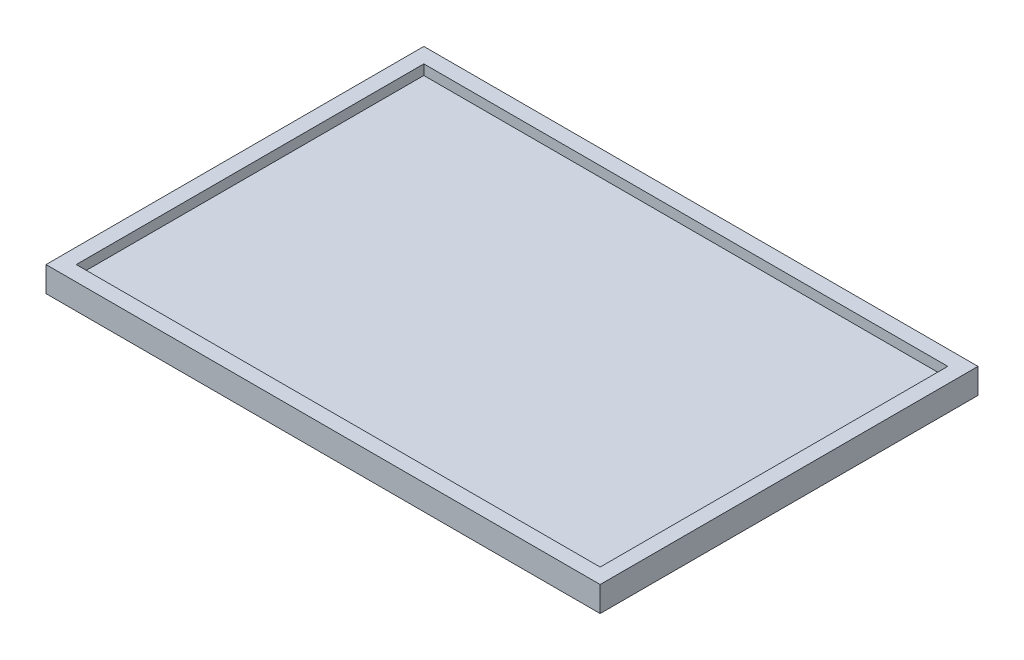
ISO-10303-21;
HEADER;
FILE_DESCRIPTION(('STEP AP214'),'2;1');
FILE_NAME('part.step','',(''),(''),'','','');
FILE_SCHEMA(('AUTOMOTIVE_DESIGN { 1 0 10303 214 1 1 1 1 }'));
ENDSEC;
DATA;
#1=APPLICATION_CONTEXT('core data for automotive mechanical design processes');
#2=APPLICATION_PROTOCOL_DEFINITION('international standard','automotive_design',2000,#1);
#3=PRODUCT_CONTEXT('',#1,'mechanical');
#4=PRODUCT('Part','Part','',(#3));
#5=PRODUCT_RELATED_PRODUCT_CATEGORY('part','',(#4));
#6=PRODUCT_DEFINITION_FORMATION('','',#4);
#7=PRODUCT_DEFINITION_CONTEXT('part definition',#1,'design');
#8=PRODUCT_DEFINITION('design','',#6,#7);
#9=PRODUCT_DEFINITION_SHAPE('','',#8);
#10=(LENGTH_UNIT() NAMED_UNIT(*) SI_UNIT(.MILLI.,.METRE.));
#11=(NAMED_UNIT(*) PLANE_ANGLE_UNIT() SI_UNIT($,.RADIAN.));
#12=(NAMED_UNIT(*) SI_UNIT($,.STERADIAN.) SOLID_ANGLE_UNIT());
#13=UNCERTAINTY_MEASURE_WITH_UNIT(LENGTH_MEASURE(1.E-05),#10,'distance_accuracy_value','');
#14=(GEOMETRIC_REPRESENTATION_CONTEXT(3) GLOBAL_UNCERTAINTY_ASSIGNED_CONTEXT((#13)) GLOBAL_UNIT_ASSIGNED_CONTEXT((#10,
#11,#12)) REPRESENTATION_CONTEXT('',''));
#15=CARTESIAN_POINT('',(0.,0.,0.));
#16=DIRECTION('',(0.,0.,1.));
#17=DIRECTION('',(1.,0.,0.));
#18=AXIS2_PLACEMENT_3D('',#15,#16,#17);
#19=CARTESIAN_POINT('',(-49.8344208809135,5.,-19.8115823817292));
#20=DIRECTION('',(1.,0.,0.));
#21=DIRECTION('',(0.,0.,-1.));
#22=AXIS2_PLACEMENT_3D('',#19,#20,#21);
#23=PLANE('',#22);
#24=DIRECTION('',(0.,0.,1.));
#25=VECTOR('',#24,1.);
#26=CARTESIAN_POINT('',(-49.8344208809135,0.,-19.8115823817292));
#27=LINE('',#26,#25);
#28=CARTESIAN_POINT('',(-49.8344208809135,0.,-19.8115823817292));
#29=VERTEX_POINT('',#28);
#30=CARTESIAN_POINT('',(-49.8344208809135,0.,55.1884176182708));
#31=VERTEX_POINT('',#30);
#32=EDGE_CURVE('E141',#29,#31,#27,.T.);
#33=ORIENTED_EDGE('',*,*,#32,.T.);
#34=DIRECTION('',(0.,-1.,0.));
#35=VECTOR('',#34,1.);
#36=CARTESIAN_POINT('',(-49.8344208809135,5.,55.1884176182708));
#37=LINE('',#36,#35);
#38=CARTESIAN_POINT('',(-49.8344208809135,5.,55.1884176182708));
#39=VERTEX_POINT('',#38);
#40=EDGE_CURVE('E11',#39,#31,#37,.T.);
#41=ORIENTED_EDGE('',*,*,#40,.F.);
#42=DIRECTION('',(0.,0.,1.));
#43=VECTOR('',#42,1.);
#44=CARTESIAN_POINT('',(-49.8344208809135,5.,-19.8115823817292));
#45=LINE('',#44,#43);
#46=CARTESIAN_POINT('',(-49.8344208809135,5.,-19.8115823817292));
#47=VERTEX_POINT('',#46);
#48=EDGE_CURVE('E145',#47,#39,#45,.T.);
#49=ORIENTED_EDGE('',*,*,#48,.F.);
#50=DIRECTION('',(0.,-1.,0.));
#51=VECTOR('',#50,1.);
#52=CARTESIAN_POINT('',(-49.8344208809135,5.,-19.8115823817292));
#53=LINE('',#52,#51);
#54=EDGE_CURVE('E151',#47,#29,#53,.T.);
#55=ORIENTED_EDGE('',*,*,#54,.T.);
#56=EDGE_LOOP('',(#33,#41,#49,#55));
#57=FACE_BOUND('',#56,.T.);
#58=ADVANCED_FACE('F33',(#57),#23,.F.);
#59=CARTESIAN_POINT('',(-49.8344208809135,5.,55.1884176182708));
#60=DIRECTION('',(0.,0.,-1.));
#61=DIRECTION('',(-1.,0.,0.));
#62=AXIS2_PLACEMENT_3D('',#59,#60,#61);
#63=PLANE('',#62);
#64=DIRECTION('',(1.,0.,0.));
#65=VECTOR('',#64,1.);
#66=CARTESIAN_POINT('',(-49.8344208809135,0.,55.1884176182708));
#67=LINE('',#66,#65);
#68=CARTESIAN_POINT('',(60.1655791190865,0.,55.1884176182708));
#69=VERTEX_POINT('',#68);
#70=EDGE_CURVE('E154',#31,#69,#67,.T.);
#71=ORIENTED_EDGE('',*,*,#70,.T.);
#72=DIRECTION('',(0.,-1.,0.));
#73=VECTOR('',#72,1.);
#74=CARTESIAN_POINT('',(60.1655791190865,5.,55.1884176182708));
#75=LINE('',#74,#73);
#76=CARTESIAN_POINT('',(60.1655791190865,5.,55.1884176182708));
#77=VERTEX_POINT('',#76);
#78=EDGE_CURVE('E40',#77,#69,#75,.T.);
#79=ORIENTED_EDGE('',*,*,#78,.F.);
#80=DIRECTION('',(1.,0.,0.));
#81=VECTOR('',#80,1.);
#82=CARTESIAN_POINT('',(-49.8344208809135,5.,55.1884176182708));
#83=LINE('',#82,#81);
#84=EDGE_CURVE('E84',#39,#77,#83,.T.);
#85=ORIENTED_EDGE('',*,*,#84,.F.);
#86=ORIENTED_EDGE('',*,*,#40,.T.);
#87=EDGE_LOOP('',(#71,#79,#85,#86));
#88=FACE_BOUND('',#87,.T.);
#89=ADVANCED_FACE('F183',(#88),#63,.F.);
#90=CARTESIAN_POINT('',(60.1655791190865,5.,-19.8115823817292));
#91=DIRECTION('',(-1.,0.,0.));
#92=DIRECTION('',(0.,0.,1.));
#93=AXIS2_PLACEMENT_3D('',#90,#91,#92);
#94=PLANE('',#93);
#95=DIRECTION('',(0.,0.,-1.));
#96=VECTOR('',#95,1.);
#97=CARTESIAN_POINT('',(60.1655791190865,0.,-19.8115823817292));
#98=LINE('',#97,#96);
#99=CARTESIAN_POINT('',(60.1655791190865,0.,-19.8115823817292));
#100=VERTEX_POINT('',#99);
#101=EDGE_CURVE('E156',#69,#100,#98,.T.);
#102=ORIENTED_EDGE('',*,*,#101,.T.);
#103=DIRECTION('',(0.,-1.,0.));
#104=VECTOR('',#103,1.);
#105=CARTESIAN_POINT('',(60.1655791190865,5.,-19.8115823817292));
#106=LINE('',#105,#104);
#107=CARTESIAN_POINT('',(60.1655791190865,5.,-19.8115823817292));
#108=VERTEX_POINT('',#107);
#109=EDGE_CURVE('E160',#108,#100,#106,.T.);
#110=ORIENTED_EDGE('',*,*,#109,.F.);
#111=DIRECTION('',(0.,0.,-1.));
#112=VECTOR('',#111,1.);
#113=CARTESIAN_POINT('',(60.1655791190865,5.,-19.8115823817292));
#114=LINE('',#113,#112);
#115=EDGE_CURVE('E148',#77,#108,#114,.T.);
#116=ORIENTED_EDGE('',*,*,#115,.F.);
#117=ORIENTED_EDGE('',*,*,#78,.T.);
#118=EDGE_LOOP('',(#102,#110,#116,#117));
#119=FACE_BOUND('',#118,.T.);
#120=ADVANCED_FACE('F165',(#119),#94,.F.);
#121=CARTESIAN_POINT('',(-49.8344208809135,5.,-19.8115823817292));
#122=DIRECTION('',(0.,0.,1.));
#123=DIRECTION('',(1.,0.,0.));
#124=AXIS2_PLACEMENT_3D('',#121,#122,#123);
#125=PLANE('',#124);
#126=DIRECTION('',(-1.,0.,0.));
#127=VECTOR('',#126,1.);
#128=CARTESIAN_POINT('',(-49.8344208809135,0.,-19.8115823817292));
#129=LINE('',#128,#127);
#130=EDGE_CURVE('E77',#100,#29,#129,.T.);
#131=ORIENTED_EDGE('',*,*,#130,.T.);
#132=ORIENTED_EDGE('',*,*,#54,.F.);
#133=DIRECTION('',(-1.,0.,0.));
#134=VECTOR('',#133,1.);
#135=CARTESIAN_POINT('',(-49.8344208809135,5.,-19.8115823817292));
#136=LINE('',#135,#134);
#137=EDGE_CURVE('E56',#108,#47,#136,.T.);
#138=ORIENTED_EDGE('',*,*,#137,.F.);
#139=ORIENTED_EDGE('',*,*,#109,.T.);
#140=EDGE_LOOP('',(#131,#132,#138,#139));
#141=FACE_BOUND('',#140,.T.);
#142=ADVANCED_FACE('F173',(#141),#125,.F.);
#143=CARTESIAN_POINT('',(0.,5.,0.));
#144=DIRECTION('',(0.,1.,0.));
#145=DIRECTION('',(0.,0.,1.));
#146=AXIS2_PLACEMENT_3D('',#143,#144,#145);
#147=PLANE('',#146);
#148=DIRECTION('',(-1.,0.,0.));
#149=VECTOR('',#148,1.);
#150=CARTESIAN_POINT('',(57.1655791190865,5.,-16.8115823817292));
#151=LINE('',#150,#149);
#152=CARTESIAN_POINT('',(57.1655791190865,5.,-16.8115823817292));
#153=VERTEX_POINT('',#152);
#154=CARTESIAN_POINT('',(-46.8344208809135,5.,-16.8115823817292));
#155=VERTEX_POINT('',#154);
#156=EDGE_CURVE('E47',#153,#155,#151,.T.);
#157=ORIENTED_EDGE('',*,*,#156,.F.);
#158=DIRECTION('',(0.,0.,-1.));
#159=VECTOR('',#158,1.);
#160=CARTESIAN_POINT('',(57.1655791190865,5.,52.1884176182708));
#161=LINE('',#160,#159);
#162=CARTESIAN_POINT('',(57.1655791190865,5.,52.1884176182708));
#163=VERTEX_POINT('',#162);
#164=EDGE_CURVE('E126',#163,#153,#161,.T.);
#165=ORIENTED_EDGE('',*,*,#164,.F.);
#166=DIRECTION('',(1.,0.,0.));
#167=VECTOR('',#166,1.);
#168=CARTESIAN_POINT('',(-46.8344208809135,5.,52.1884176182708));
#169=LINE('',#168,#167);
#170=CARTESIAN_POINT('',(-46.8344208809135,5.,52.1884176182708));
#171=VERTEX_POINT('',#170);
#172=EDGE_CURVE('E129',#171,#163,#169,.T.);
#173=ORIENTED_EDGE('',*,*,#172,.F.);
#174=DIRECTION('',(0.,0.,1.));
#175=VECTOR('',#174,1.);
#176=CARTESIAN_POINT('',(-46.8344208809135,5.,-16.8115823817292));
#177=LINE('',#176,#175);
#178=EDGE_CURVE('E135',#155,#171,#177,.T.);
#179=ORIENTED_EDGE('',*,*,#178,.F.);
#180=EDGE_LOOP('',(#157,#165,#173,#179));
#181=FACE_BOUND('',#180,.T.);
#182=ORIENTED_EDGE('',*,*,#48,.T.);
#183=ORIENTED_EDGE('',*,*,#84,.T.);
#184=ORIENTED_EDGE('',*,*,#115,.T.);
#185=ORIENTED_EDGE('',*,*,#137,.T.);
#186=EDGE_LOOP('',(#182,#183,#184,#185));
#187=FACE_BOUND('',#186,.T.);
#188=ADVANCED_FACE('F175',(#181,#187),#147,.T.);
#189=CARTESIAN_POINT('',(0.,0.,0.));
#190=DIRECTION('',(0.,1.,0.));
#191=DIRECTION('',(0.,0.,1.));
#192=AXIS2_PLACEMENT_3D('',#189,#190,#191);
#193=PLANE('',#192);
#194=ORIENTED_EDGE('',*,*,#32,.F.);
#195=ORIENTED_EDGE('',*,*,#130,.F.);
#196=ORIENTED_EDGE('',*,*,#101,.F.);
#197=ORIENTED_EDGE('',*,*,#70,.F.);
#198=EDGE_LOOP('',(#194,#195,#196,#197));
#199=FACE_BOUND('',#198,.T.);
#200=ADVANCED_FACE('F169',(#199),#193,.F.);
#201=CARTESIAN_POINT('',(57.1655791190865,3.,-16.8115823817292));
#202=DIRECTION('',(0.,0.,-1.));
#203=DIRECTION('',(-1.,0.,0.));
#204=AXIS2_PLACEMENT_3D('',#201,#202,#203);
#205=PLANE('',#204);
#206=ORIENTED_EDGE('',*,*,#156,.T.);
#207=DIRECTION('',(0.,1.,0.));
#208=VECTOR('',#207,1.);
#209=CARTESIAN_POINT('',(-46.8344208809135,3.,-16.8115823817292));
#210=LINE('',#209,#208);
#211=CARTESIAN_POINT('',(-46.8344208809135,3.,-16.8115823817292));
#212=VERTEX_POINT('',#211);
#213=EDGE_CURVE('E104',#212,#155,#210,.T.);
#214=ORIENTED_EDGE('',*,*,#213,.F.);
#215=DIRECTION('',(-1.,0.,0.));
#216=VECTOR('',#215,1.);
#217=CARTESIAN_POINT('',(57.1655791190865,3.,-16.8115823817292));
#218=LINE('',#217,#216);
#219=CARTESIAN_POINT('',(57.1655791190865,3.,-16.8115823817292));
#220=VERTEX_POINT('',#219);
#221=EDGE_CURVE('E108',#220,#212,#218,.T.);
#222=ORIENTED_EDGE('',*,*,#221,.F.);
#223=DIRECTION('',(0.,1.,0.));
#224=VECTOR('',#223,1.);
#225=CARTESIAN_POINT('',(57.1655791190865,3.,-16.8115823817292));
#226=LINE('',#225,#224);
#227=EDGE_CURVE('E139',#220,#153,#226,.T.);
#228=ORIENTED_EDGE('',*,*,#227,.T.);
#229=EDGE_LOOP('',(#206,#214,#222,#228));
#230=FACE_BOUND('',#229,.T.);
#231=ADVANCED_FACE('F106',(#230),#205,.F.);
#232=CARTESIAN_POINT('',(57.1655791190865,3.,52.1884176182708));
#233=DIRECTION('',(1.,0.,0.));
#234=DIRECTION('',(0.,0.,-1.));
#235=AXIS2_PLACEMENT_3D('',#232,#233,#234);
#236=PLANE('',#235);
#237=ORIENTED_EDGE('',*,*,#164,.T.);
#238=ORIENTED_EDGE('',*,*,#227,.F.);
#239=DIRECTION('',(0.,0.,-1.));
#240=VECTOR('',#239,1.);
#241=CARTESIAN_POINT('',(57.1655791190865,3.,52.1884176182708));
#242=LINE('',#241,#240);
#243=CARTESIAN_POINT('',(57.1655791190865,3.,52.1884176182708));
#244=VERTEX_POINT('',#243);
#245=EDGE_CURVE('E114',#244,#220,#242,.T.);
#246=ORIENTED_EDGE('',*,*,#245,.F.);
#247=DIRECTION('',(0.,1.,0.));
#248=VECTOR('',#247,1.);
#249=CARTESIAN_POINT('',(57.1655791190865,3.,52.1884176182708));
#250=LINE('',#249,#248);
#251=EDGE_CURVE('E142',#244,#163,#250,.T.);
#252=ORIENTED_EDGE('',*,*,#251,.T.);
#253=EDGE_LOOP('',(#237,#238,#246,#252));
#254=FACE_BOUND('',#253,.T.);
#255=ADVANCED_FACE('F222',(#254),#236,.F.);
#256=CARTESIAN_POINT('',(-46.8344208809135,3.,52.1884176182708));
#257=DIRECTION('',(0.,0.,1.));
#258=DIRECTION('',(1.,0.,0.));
#259=AXIS2_PLACEMENT_3D('',#256,#257,#258);
#260=PLANE('',#259);
#261=ORIENTED_EDGE('',*,*,#172,.T.);
#262=ORIENTED_EDGE('',*,*,#251,.F.);
#263=DIRECTION('',(1.,0.,0.));
#264=VECTOR('',#263,1.);
#265=CARTESIAN_POINT('',(-46.8344208809135,3.,52.1884176182708));
#266=LINE('',#265,#264);
#267=CARTESIAN_POINT('',(-46.8344208809135,3.,52.1884176182708));
#268=VERTEX_POINT('',#267);
#269=EDGE_CURVE('E122',#268,#244,#266,.T.);
#270=ORIENTED_EDGE('',*,*,#269,.F.);
#271=DIRECTION('',(0.,1.,0.));
#272=VECTOR('',#271,1.);
#273=CARTESIAN_POINT('',(-46.8344208809135,3.,52.1884176182708));
#274=LINE('',#273,#272);
#275=EDGE_CURVE('E113',#268,#171,#274,.T.);
#276=ORIENTED_EDGE('',*,*,#275,.T.);
#277=EDGE_LOOP('',(#261,#262,#270,#276));
#278=FACE_BOUND('',#277,.T.);
#279=ADVANCED_FACE('F231',(#278),#260,.F.);
#280=CARTESIAN_POINT('',(-46.8344208809135,3.,-16.8115823817292));
#281=DIRECTION('',(-1.,0.,0.));
#282=DIRECTION('',(0.,0.,1.));
#283=AXIS2_PLACEMENT_3D('',#280,#281,#282);
#284=PLANE('',#283);
#285=ORIENTED_EDGE('',*,*,#178,.T.);
#286=ORIENTED_EDGE('',*,*,#275,.F.);
#287=DIRECTION('',(0.,0.,1.));
#288=VECTOR('',#287,1.);
#289=CARTESIAN_POINT('',(-46.8344208809135,3.,-16.8115823817292));
#290=LINE('',#289,#288);
#291=EDGE_CURVE('E117',#212,#268,#290,.T.);
#292=ORIENTED_EDGE('',*,*,#291,.F.);
#293=ORIENTED_EDGE('',*,*,#213,.T.);
#294=EDGE_LOOP('',(#285,#286,#292,#293));
#295=FACE_BOUND('',#294,.T.);
#296=ADVANCED_FACE('F118',(#295),#284,.F.);
#297=CARTESIAN_POINT('',(0.,3.,0.));
#298=DIRECTION('',(0.,1.,0.));
#299=DIRECTION('',(0.,0.,1.));
#300=AXIS2_PLACEMENT_3D('',#297,#298,#299);
#301=PLANE('',#300);
#302=ORIENTED_EDGE('',*,*,#221,.T.);
#303=ORIENTED_EDGE('',*,*,#291,.T.);
#304=ORIENTED_EDGE('',*,*,#269,.T.);
#305=ORIENTED_EDGE('',*,*,#245,.T.);
#306=EDGE_LOOP('',(#302,#303,#304,#305));
#307=FACE_BOUND('',#306,.T.);
#308=ADVANCED_FACE('F124',(#307),#301,.T.);
#309=CLOSED_SHELL('',(#58,#89,#120,#142,#188,#200,#231,#255,#279,#296,#308));
#310=MANIFOLD_SOLID_BREP('B2',#309);
#311=ADVANCED_BREP_SHAPE_REPRESENTATION('',(#18,#310),#14);
#312=SHAPE_DEFINITION_REPRESENTATION(#9,#311);
ENDSEC;
END-ISO-10303-21;
